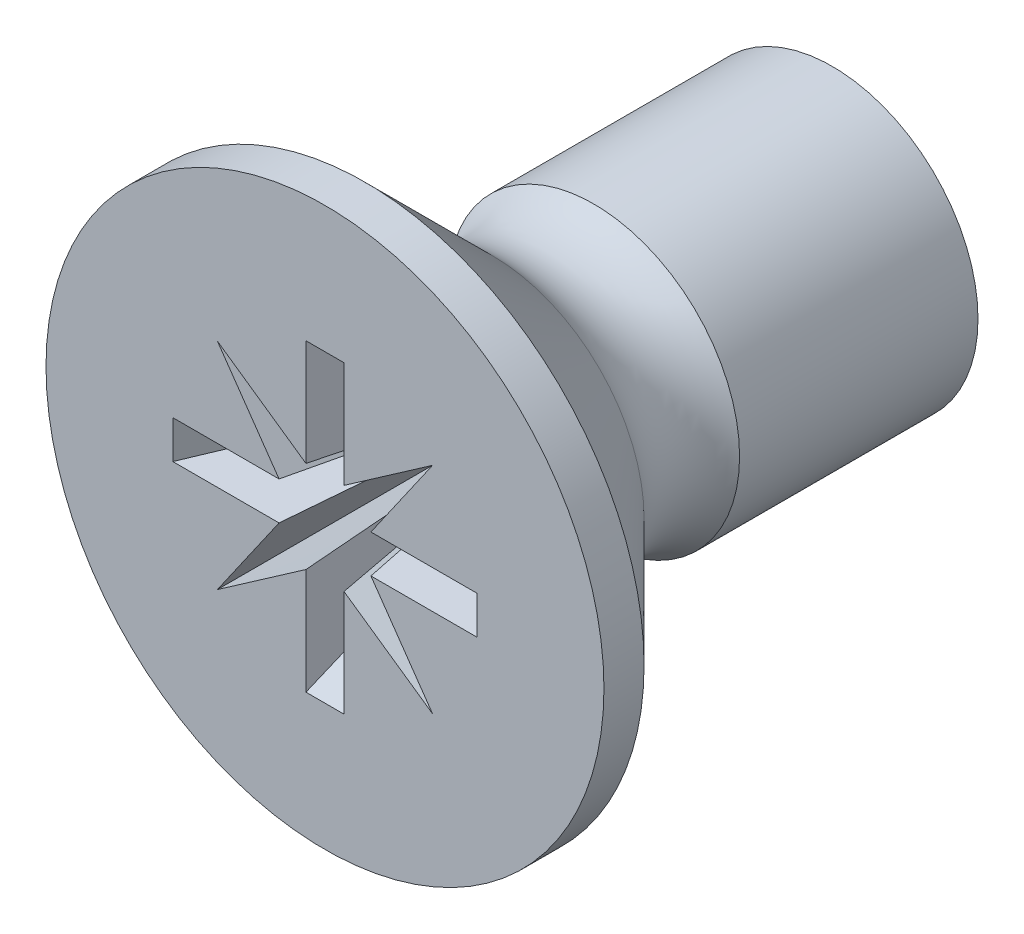
ISO-10303-21;
HEADER;
FILE_DESCRIPTION(('STEP AP214'),'2;1');
FILE_NAME('part.step','',(''),(''),'','','');
FILE_SCHEMA(('AUTOMOTIVE_DESIGN { 1 0 10303 214 1 1 1 1 }'));
ENDSEC;
DATA;
#1=APPLICATION_CONTEXT('core data for automotive mechanical design processes');
#2=APPLICATION_PROTOCOL_DEFINITION('international standard','automotive_design',2000,#1);
#3=PRODUCT_CONTEXT('',#1,'mechanical');
#4=PRODUCT('Part','Part','',(#3));
#5=PRODUCT_RELATED_PRODUCT_CATEGORY('part','',(#4));
#6=PRODUCT_DEFINITION_FORMATION('','',#4);
#7=PRODUCT_DEFINITION_CONTEXT('part definition',#1,'design');
#8=PRODUCT_DEFINITION('design','',#6,#7);
#9=PRODUCT_DEFINITION_SHAPE('','',#8);
#10=(LENGTH_UNIT() NAMED_UNIT(*) SI_UNIT(.MILLI.,.METRE.));
#11=(NAMED_UNIT(*) PLANE_ANGLE_UNIT() SI_UNIT($,.RADIAN.));
#12=(NAMED_UNIT(*) SI_UNIT($,.STERADIAN.) SOLID_ANGLE_UNIT());
#13=UNCERTAINTY_MEASURE_WITH_UNIT(LENGTH_MEASURE(1.E-05),#10,'distance_accuracy_value','');
#14=(GEOMETRIC_REPRESENTATION_CONTEXT(3) GLOBAL_UNCERTAINTY_ASSIGNED_CONTEXT((#13)) GLOBAL_UNIT_ASSIGNED_CONTEXT((#10,
#11,#12)) REPRESENTATION_CONTEXT('',''));
#15=CARTESIAN_POINT('',(0.,0.,0.));
#16=DIRECTION('',(0.,0.,1.));
#17=DIRECTION('',(1.,0.,0.));
#18=AXIS2_PLACEMENT_3D('',#15,#16,#17);
#19=CARTESIAN_POINT('',(0.,0.,-2.18276027382699));
#20=DIRECTION('',(0.,0.,-1.));
#21=DIRECTION('',(-1.,0.,0.));
#22=AXIS2_PLACEMENT_3D('',#19,#20,#21);
#23=TOROIDAL_SURFACE('',#22,2.02806180473974,0.753436804739735);
#24=CARTESIAN_POINT('',(0.,0.,-2.65));
#25=DIRECTION('',(0.,0.,-1.));
#26=DIRECTION('',(-1.,0.,0.));
#27=AXIS2_PLACEMENT_3D('',#24,#25,#26);
#28=CIRCLE('',#27,1.437);
#29=CARTESIAN_POINT('',(-1.437,0.,-2.65));
#30=VERTEX_POINT('',#29);
#31=EDGE_CURVE('E11',#30,#30,#28,.T.);
#32=ORIENTED_EDGE('',*,*,#31,.F.);
#33=EDGE_LOOP('',(#32));
#34=FACE_BOUND('',#33,.T.);
#35=CARTESIAN_POINT('',(0.,0.,-1.65));
#36=DIRECTION('',(0.,0.,-1.));
#37=DIRECTION('',(-1.,0.,0.));
#38=AXIS2_PLACEMENT_3D('',#35,#36,#37);
#39=CIRCLE('',#38,1.49530153091274);
#40=CARTESIAN_POINT('',(-1.49530153091274,0.,-1.65));
#41=VERTEX_POINT('',#40);
#42=EDGE_CURVE('E681',#41,#41,#39,.T.);
#43=ORIENTED_EDGE('',*,*,#42,.T.);
#44=EDGE_LOOP('',(#43));
#45=FACE_BOUND('',#44,.T.);
#46=ADVANCED_FACE('F17',(#34,#45),#23,.F.);
#47=CARTESIAN_POINT('',(0.,0.,0.));
#48=DIRECTION('',(0.,0.,-1.));
#49=DIRECTION('',(-1.,0.,0.));
#50=AXIS2_PLACEMENT_3D('',#47,#48,#49);
#51=CYLINDRICAL_SURFACE('',#50,1.437);
#52=CARTESIAN_POINT('',(0.,0.,-5.));
#53=DIRECTION('',(0.,0.,-1.));
#54=DIRECTION('',(-1.,0.,0.));
#55=AXIS2_PLACEMENT_3D('',#52,#53,#54);
#56=CIRCLE('',#55,1.437);
#57=CARTESIAN_POINT('',(-1.437,0.,-5.));
#58=VERTEX_POINT('',#57);
#59=EDGE_CURVE('E27',#58,#58,#56,.T.);
#60=ORIENTED_EDGE('',*,*,#59,.F.);
#61=EDGE_LOOP('',(#60));
#62=FACE_BOUND('',#61,.T.);
#63=ORIENTED_EDGE('',*,*,#31,.T.);
#64=EDGE_LOOP('',(#63));
#65=FACE_BOUND('',#64,.T.);
#66=ADVANCED_FACE('F671',(#62,#65),#51,.T.);
#67=CARTESIAN_POINT('',(0.,1.437,-5.));
#68=DIRECTION('',(0.,0.,1.));
#69=DIRECTION('',(1.,0.,0.));
#70=AXIS2_PLACEMENT_3D('',#67,#68,#69);
#71=PLANE('',#70);
#72=ORIENTED_EDGE('',*,*,#59,.T.);
#73=EDGE_LOOP('',(#72));
#74=FACE_BOUND('',#73,.T.);
#75=ADVANCED_FACE('F257',(#74),#71,.F.);
#76=CARTESIAN_POINT('',(0.,0.,0.));
#77=DIRECTION('',(0.,0.,-1.));
#78=DIRECTION('',(-1.,0.,0.));
#79=AXIS2_PLACEMENT_3D('',#76,#77,#78);
#80=PLANE('',#79);
#81=DIRECTION('',(0.,-1.,0.));
#82=VECTOR('',#81,1.);
#83=CARTESIAN_POINT('',(0.1875,-0.976332521472478,0.));
#84=LINE('',#83,#82);
#85=CARTESIAN_POINT('',(0.1875,-0.452665042944956,0.));
#86=VERTEX_POINT('',#85);
#87=CARTESIAN_POINT('',(0.1875,-1.5,0.));
#88=VERTEX_POINT('',#87);
#89=EDGE_CURVE('E177',#86,#88,#84,.T.);
#90=ORIENTED_EDGE('',*,*,#89,.T.);
#91=DIRECTION('',(-1.,0.,0.));
#92=VECTOR('',#91,1.);
#93=CARTESIAN_POINT('',(-0.09375,-1.5,0.));
#94=LINE('',#93,#92);
#95=CARTESIAN_POINT('',(-0.1875,-1.5,0.));
#96=VERTEX_POINT('',#95);
#97=EDGE_CURVE('E167',#88,#96,#94,.T.);
#98=ORIENTED_EDGE('',*,*,#97,.T.);
#99=DIRECTION('',(0.,1.,0.));
#100=VECTOR('',#99,1.);
#101=CARTESIAN_POINT('',(-0.1875,-0.976332521472478,0.));
#102=LINE('',#101,#100);
#103=CARTESIAN_POINT('',(-0.1875,-0.452665042944955,0.));
#104=VERTEX_POINT('',#103);
#105=EDGE_CURVE('E41',#96,#104,#102,.T.);
#106=ORIENTED_EDGE('',*,*,#105,.T.);
#107=CARTESIAN_POINT('',(-1.06066017177982,-1.06066017177982,0.));
#108=CARTESIAN_POINT('',(-0.1875,-0.452665042944956,0.));
#109=B_SPLINE_CURVE_WITH_KNOTS('',1,(#107,#108),.UNSPECIFIED.,.F.,.F.,(2,2),(0.,1.),.UNSPECIFIED.);
#110=CARTESIAN_POINT('',(-1.06066017177982,-1.06066017177982,0.));
#111=VERTEX_POINT('',#110);
#112=EDGE_CURVE('E527',#111,#104,#109,.T.);
#113=ORIENTED_EDGE('',*,*,#112,.F.);
#114=CARTESIAN_POINT('',(-0.452665042944956,-0.1875,0.));
#115=CARTESIAN_POINT('',(-1.06066017177982,-1.06066017177982,0.));
#116=B_SPLINE_CURVE_WITH_KNOTS('',1,(#114,#115),.UNSPECIFIED.,.F.,.F.,(2,2),(0.,1.),.UNSPECIFIED.);
#117=CARTESIAN_POINT('',(-0.452665042944956,-0.1875,0.));
#118=VERTEX_POINT('',#117);
#119=EDGE_CURVE('E546',#118,#111,#116,.T.);
#120=ORIENTED_EDGE('',*,*,#119,.F.);
#121=DIRECTION('',(-1.,0.,0.));
#122=VECTOR('',#121,1.);
#123=CARTESIAN_POINT('',(-0.976332521472478,-0.1875,0.));
#124=LINE('',#123,#122);
#125=CARTESIAN_POINT('',(-1.5,-0.1875,0.));
#126=VERTEX_POINT('',#125);
#127=EDGE_CURVE('E549',#118,#126,#124,.T.);
#128=ORIENTED_EDGE('',*,*,#127,.T.);
#129=DIRECTION('',(0.,1.,0.));
#130=VECTOR('',#129,1.);
#131=CARTESIAN_POINT('',(-1.5,-0.09375,0.));
#132=LINE('',#131,#130);
#133=CARTESIAN_POINT('',(-1.5,0.1875,0.));
#134=VERTEX_POINT('',#133);
#135=EDGE_CURVE('E565',#126,#134,#132,.T.);
#136=ORIENTED_EDGE('',*,*,#135,.T.);
#137=DIRECTION('',(1.,0.,0.));
#138=VECTOR('',#137,1.);
#139=CARTESIAN_POINT('',(-0.976332521472478,0.1875,0.));
#140=LINE('',#139,#138);
#141=CARTESIAN_POINT('',(-0.452665042944956,0.1875,0.));
#142=VERTEX_POINT('',#141);
#143=EDGE_CURVE('E588',#134,#142,#140,.T.);
#144=ORIENTED_EDGE('',*,*,#143,.T.);
#145=CARTESIAN_POINT('',(-1.06066017177982,1.06066017177982,0.));
#146=CARTESIAN_POINT('',(-0.452665042944956,0.1875,0.));
#147=B_SPLINE_CURVE_WITH_KNOTS('',1,(#145,#146),.UNSPECIFIED.,.F.,.F.,(2,2),(0.,1.),.UNSPECIFIED.);
#148=CARTESIAN_POINT('',(-1.06066017177982,1.06066017177982,0.));
#149=VERTEX_POINT('',#148);
#150=EDGE_CURVE('E596',#149,#142,#147,.T.);
#151=ORIENTED_EDGE('',*,*,#150,.F.);
#152=CARTESIAN_POINT('',(-0.1875,0.452665042944956,0.));
#153=CARTESIAN_POINT('',(-1.06066017177982,1.06066017177982,0.));
#154=B_SPLINE_CURVE_WITH_KNOTS('',1,(#152,#153),.UNSPECIFIED.,.F.,.F.,(2,2),(0.,1.),.UNSPECIFIED.);
#155=CARTESIAN_POINT('',(-0.1875,0.452665042944956,0.));
#156=VERTEX_POINT('',#155);
#157=EDGE_CURVE('E609',#156,#149,#154,.T.);
#158=ORIENTED_EDGE('',*,*,#157,.F.);
#159=DIRECTION('',(0.,1.,0.));
#160=VECTOR('',#159,1.);
#161=CARTESIAN_POINT('',(-0.1875,0.976332521472478,0.));
#162=LINE('',#161,#160);
#163=CARTESIAN_POINT('',(-0.1875,1.5,0.));
#164=VERTEX_POINT('',#163);
#165=EDGE_CURVE('E612',#156,#164,#162,.T.);
#166=ORIENTED_EDGE('',*,*,#165,.T.);
#167=DIRECTION('',(1.,0.,0.));
#168=VECTOR('',#167,1.);
#169=CARTESIAN_POINT('',(-0.09375,1.5,0.));
#170=LINE('',#169,#168);
#171=CARTESIAN_POINT('',(0.1875,1.5,0.));
#172=VERTEX_POINT('',#171);
#173=EDGE_CURVE('E629',#164,#172,#170,.T.);
#174=ORIENTED_EDGE('',*,*,#173,.T.);
#175=DIRECTION('',(0.,-1.,0.));
#176=VECTOR('',#175,1.);
#177=CARTESIAN_POINT('',(0.1875,0.976332521472478,0.));
#178=LINE('',#177,#176);
#179=CARTESIAN_POINT('',(0.1875,0.452665042944956,0.));
#180=VERTEX_POINT('',#179);
#181=EDGE_CURVE('E326',#172,#180,#178,.T.);
#182=ORIENTED_EDGE('',*,*,#181,.T.);
#183=CARTESIAN_POINT('',(1.06066017177982,1.06066017177982,0.));
#184=CARTESIAN_POINT('',(0.1875,0.452665042944956,0.));
#185=B_SPLINE_CURVE_WITH_KNOTS('',1,(#183,#184),.UNSPECIFIED.,.F.,.F.,(2,2),(0.,1.),.UNSPECIFIED.);
#186=CARTESIAN_POINT('',(1.06066017177982,1.06066017177982,0.));
#187=VERTEX_POINT('',#186);
#188=EDGE_CURVE('E303',#187,#180,#185,.T.);
#189=ORIENTED_EDGE('',*,*,#188,.F.);
#190=CARTESIAN_POINT('',(0.452665042944956,0.1875,0.));
#191=CARTESIAN_POINT('',(1.06066017177982,1.06066017177982,0.));
#192=B_SPLINE_CURVE_WITH_KNOTS('',1,(#190,#191),.UNSPECIFIED.,.F.,.F.,(2,2),(0.,1.),.UNSPECIFIED.);
#193=CARTESIAN_POINT('',(0.452665042944956,0.1875,0.));
#194=VERTEX_POINT('',#193);
#195=EDGE_CURVE('E297',#194,#187,#192,.T.);
#196=ORIENTED_EDGE('',*,*,#195,.F.);
#197=DIRECTION('',(1.,0.,0.));
#198=VECTOR('',#197,1.);
#199=CARTESIAN_POINT('',(0.976332521472478,0.1875,0.));
#200=LINE('',#199,#198);
#201=CARTESIAN_POINT('',(1.5,0.1875,0.));
#202=VERTEX_POINT('',#201);
#203=EDGE_CURVE('E300',#194,#202,#200,.T.);
#204=ORIENTED_EDGE('',*,*,#203,.T.);
#205=DIRECTION('',(0.,-1.,0.));
#206=VECTOR('',#205,1.);
#207=CARTESIAN_POINT('',(1.5,0.09375,0.));
#208=LINE('',#207,#206);
#209=CARTESIAN_POINT('',(1.5,-0.1875,0.));
#210=VERTEX_POINT('',#209);
#211=EDGE_CURVE('E497',#202,#210,#208,.T.);
#212=ORIENTED_EDGE('',*,*,#211,.T.);
#213=DIRECTION('',(-1.,0.,0.));
#214=VECTOR('',#213,1.);
#215=CARTESIAN_POINT('',(0.976332521472478,-0.1875,0.));
#216=LINE('',#215,#214);
#217=CARTESIAN_POINT('',(0.452665042944956,-0.1875,0.));
#218=VERTEX_POINT('',#217);
#219=EDGE_CURVE('E468',#210,#218,#216,.T.);
#220=ORIENTED_EDGE('',*,*,#219,.T.);
#221=CARTESIAN_POINT('',(1.06066017177982,-1.06066017177982,0.));
#222=CARTESIAN_POINT('',(0.452665042944956,-0.1875,0.));
#223=B_SPLINE_CURVE_WITH_KNOTS('',1,(#221,#222),.UNSPECIFIED.,.F.,.F.,(2,2),(0.,1.),.UNSPECIFIED.);
#224=CARTESIAN_POINT('',(1.06066017177982,-1.06066017177982,0.));
#225=VERTEX_POINT('',#224);
#226=EDGE_CURVE('E236',#225,#218,#223,.T.);
#227=ORIENTED_EDGE('',*,*,#226,.F.);
#228=CARTESIAN_POINT('',(0.1875,-0.452665042944956,0.));
#229=CARTESIAN_POINT('',(1.06066017177982,-1.06066017177982,0.));
#230=B_SPLINE_CURVE_WITH_KNOTS('',1,(#228,#229),.UNSPECIFIED.,.F.,.F.,(2,2),(0.,1.),.UNSPECIFIED.);
#231=EDGE_CURVE('E194',#86,#225,#230,.T.);
#232=ORIENTED_EDGE('',*,*,#231,.F.);
#233=EDGE_LOOP('',(#90,#98,#106,#113,#120,#128,#136,#144,#151,#158,#166,#174,#182,#189,#196,
#204,#212,#220,#227,#232));
#234=FACE_BOUND('',#233,.T.);
#235=CARTESIAN_POINT('',(0.,0.,0.));
#236=DIRECTION('',(0.,0.,-1.));
#237=DIRECTION('',(-1.,0.,0.));
#238=AXIS2_PLACEMENT_3D('',#235,#236,#237);
#239=CIRCLE('',#238,2.75);
#240=CARTESIAN_POINT('',(-2.75,0.,0.));
#241=VERTEX_POINT('',#240);
#242=EDGE_CURVE('E686',#241,#241,#239,.T.);
#243=ORIENTED_EDGE('',*,*,#242,.F.);
#244=EDGE_LOOP('',(#243));
#245=FACE_BOUND('',#244,.T.);
#246=ADVANCED_FACE('F238',(#234,#245),#80,.F.);
#247=CARTESIAN_POINT('',(0.,0.,0.));
#248=DIRECTION('',(0.,0.,-1.));
#249=DIRECTION('',(-1.,0.,0.));
#250=AXIS2_PLACEMENT_3D('',#247,#248,#249);
#251=CYLINDRICAL_SURFACE('',#250,2.75);
#252=CARTESIAN_POINT('',(0.,0.,-0.395301530912757));
#253=DIRECTION('',(0.,0.,-1.));
#254=DIRECTION('',(-1.,0.,0.));
#255=AXIS2_PLACEMENT_3D('',#252,#253,#254);
#256=CIRCLE('',#255,2.75);
#257=CARTESIAN_POINT('',(-2.75,0.,-0.395301530912757));
#258=VERTEX_POINT('',#257);
#259=EDGE_CURVE('E683',#258,#258,#256,.T.);
#260=ORIENTED_EDGE('',*,*,#259,.F.);
#261=EDGE_LOOP('',(#260));
#262=FACE_BOUND('',#261,.T.);
#263=ORIENTED_EDGE('',*,*,#242,.T.);
#264=EDGE_LOOP('',(#263));
#265=FACE_BOUND('',#264,.T.);
#266=ADVANCED_FACE('F256',(#262,#265),#251,.T.);
#267=CARTESIAN_POINT('',(0.,0.,-0.395301530912757));
#268=DIRECTION('',(0.,0.,1.));
#269=DIRECTION('',(1.,0.,0.));
#270=AXIS2_PLACEMENT_3D('',#267,#268,#269);
#271=CONICAL_SURFACE('',#270,2.75,0.785398163397454);
#272=ORIENTED_EDGE('',*,*,#42,.F.);
#273=EDGE_LOOP('',(#272));
#274=FACE_BOUND('',#273,.T.);
#275=ORIENTED_EDGE('',*,*,#259,.T.);
#276=EDGE_LOOP('',(#275));
#277=FACE_BOUND('',#276,.T.);
#278=ADVANCED_FACE('F832',(#274,#277),#271,.T.);
#279=CARTESIAN_POINT('',(0.13125,-1.05,-0.88));
#280=DIRECTION('',(-0.997963326741809,0.,0.0637902694650302));
#281=DIRECTION('',(0.0637902694650302,0.,0.997963326741809));
#282=AXIS2_PLACEMENT_3D('',#279,#280,#281);
#283=PLANE('',#282);
#284=CARTESIAN_POINT('',(0.075,-0.181066017177982,-1.76));
#285=CARTESIAN_POINT('',(0.1875,-0.452665042944956,0.));
#286=B_SPLINE_CURVE_WITH_KNOTS('',1,(#284,#285),.UNSPECIFIED.,.F.,.F.,(2,2),(0.,1.),.UNSPECIFIED.);
#287=CARTESIAN_POINT('',(0.075,-0.181066017177982,-1.76));
#288=VERTEX_POINT('',#287);
#289=EDGE_CURVE('E180',#288,#86,#286,.T.);
#290=ORIENTED_EDGE('',*,*,#289,.F.);
#291=DIRECTION('',(0.,-1.,0.));
#292=VECTOR('',#291,1.);
#293=CARTESIAN_POINT('',(0.075,-0.390533008588991,-1.76));
#294=LINE('',#293,#292);
#295=CARTESIAN_POINT('',(0.075,-0.6,-1.76));
#296=VERTEX_POINT('',#295);
#297=EDGE_CURVE('E163',#288,#296,#294,.T.);
#298=ORIENTED_EDGE('',*,*,#297,.T.);
#299=DIRECTION('',(0.0568192235279889,-0.454553788223912,0.888905185860094));
#300=VECTOR('',#299,1.);
#301=CARTESIAN_POINT('',(0.13125,-1.05,-0.88));
#302=LINE('',#301,#300);
#303=EDGE_CURVE('E171',#296,#88,#302,.T.);
#304=ORIENTED_EDGE('',*,*,#303,.T.);
#305=ORIENTED_EDGE('',*,*,#89,.F.);
#306=EDGE_LOOP('',(#290,#298,#304,#305));
#307=FACE_BOUND('',#306,.T.);
#308=ADVANCED_FACE('F179',(#307),#283,.T.);
#309=CARTESIAN_POINT('',(0.419478270999549,-0.41947827099955,-1.76));
#310=CARTESIAN_POINT('',(1.06066017177982,-1.06066017177982,0.));
#311=CARTESIAN_POINT('',(0.075,-0.181066017177982,-1.76));
#312=CARTESIAN_POINT('',(0.1875,-0.452665042944956,0.));
#313=B_SPLINE_SURFACE_WITH_KNOTS('',1,1,((#309,#310),(#311,#312)),.UNSPECIFIED.,.F.,.F.,.F.,(2,
2),(2,2),(0.,1.),(0.,1.),.UNSPECIFIED.);
#314=CARTESIAN_POINT('',(0.419478270999549,-0.41947827099955,-1.76));
#315=CARTESIAN_POINT('',(0.075,-0.181066017177982,-1.76));
#316=B_SPLINE_CURVE_WITH_KNOTS('',1,(#314,#315),.UNSPECIFIED.,.F.,.F.,(2,2),(0.,1.),.UNSPECIFIED.);
#317=CARTESIAN_POINT('',(0.419478270999549,-0.41947827099955,-1.76));
#318=VERTEX_POINT('',#317);
#319=EDGE_CURVE('E235',#318,#288,#316,.T.);
#320=CARTESIAN_POINT('',(0.419478270999549,-0.41947827099955,-1.76));
#321=CARTESIAN_POINT('',(1.06066017177982,-1.06066017177982,0.));
#322=B_SPLINE_CURVE_WITH_KNOTS('',1,(#320,#321),.UNSPECIFIED.,.F.,.F.,(2,2),(0.,1.),.UNSPECIFIED.);
#323=EDGE_CURVE('E476',#318,#225,#322,.T.);
#324=ORIENTED_EDGE('',*,*,#319,.T.);
#325=ORIENTED_EDGE('',*,*,#289,.T.);
#326=ORIENTED_EDGE('',*,*,#231,.T.);
#327=ORIENTED_EDGE('',*,*,#323,.F.);
#328=EDGE_LOOP('',(#324,#325,#326,#327));
#329=FACE_BOUND('',#328,.T.);
#330=ADVANCED_FACE('F201',(#329),#313,.T.);
#331=CARTESIAN_POINT('',(0.181066017177982,-0.075,-1.76));
#332=CARTESIAN_POINT('',(0.452665042944956,-0.1875,0.));
#333=CARTESIAN_POINT('',(0.419478270999549,-0.41947827099955,-1.76));
#334=CARTESIAN_POINT('',(1.06066017177982,-1.06066017177982,0.));
#335=B_SPLINE_SURFACE_WITH_KNOTS('',1,1,((#331,#332),(#333,#334)),.UNSPECIFIED.,.F.,.F.,.F.,(2,
2),(2,2),(0.,1.),(0.,1.),.UNSPECIFIED.);
#336=CARTESIAN_POINT('',(0.181066017177982,-0.075,-1.76));
#337=CARTESIAN_POINT('',(0.419478270999549,-0.41947827099955,-1.76));
#338=B_SPLINE_CURVE_WITH_KNOTS('',1,(#336,#337),.UNSPECIFIED.,.F.,.F.,(2,2),(0.,1.),.UNSPECIFIED.);
#339=CARTESIAN_POINT('',(0.181066017177982,-0.075,-1.76));
#340=VERTEX_POINT('',#339);
#341=EDGE_CURVE('E457',#340,#318,#338,.T.);
#342=DIRECTION('',(0.152208939027645,-0.0630470068596701,0.986335396204615));
#343=VECTOR('',#342,1.);
#344=CARTESIAN_POINT('',(0.316865530061469,-0.13125,-0.88));
#345=LINE('',#344,#343);
#346=EDGE_CURVE('E461',#340,#218,#345,.T.);
#347=ORIENTED_EDGE('',*,*,#341,.T.);
#348=ORIENTED_EDGE('',*,*,#323,.T.);
#349=ORIENTED_EDGE('',*,*,#226,.T.);
#350=ORIENTED_EDGE('',*,*,#346,.F.);
#351=EDGE_LOOP('',(#347,#348,#349,#350));
#352=FACE_BOUND('',#351,.T.);
#353=ADVANCED_FACE('F213',(#352),#335,.T.);
#354=CARTESIAN_POINT('',(1.05,-0.13125,-0.88));
#355=DIRECTION('',(0.,0.997963326741809,0.0637902694650306));
#356=DIRECTION('',(0.,-0.0637902694650306,0.997963326741809));
#357=AXIS2_PLACEMENT_3D('',#354,#355,#356);
#358=PLANE('',#357);
#359=DIRECTION('',(0.454553788223912,-0.056819223527989,0.888905185860094));
#360=VECTOR('',#359,1.);
#361=CARTESIAN_POINT('',(1.05,-0.13125,-0.88));
#362=LINE('',#361,#360);
#363=CARTESIAN_POINT('',(0.6,-0.075,-1.76));
#364=VERTEX_POINT('',#363);
#365=EDGE_CURVE('E500',#364,#210,#362,.T.);
#366=ORIENTED_EDGE('',*,*,#365,.F.);
#367=DIRECTION('',(-1.,0.,0.));
#368=VECTOR('',#367,1.);
#369=CARTESIAN_POINT('',(0.390533008588991,-0.075,-1.76));
#370=LINE('',#369,#368);
#371=EDGE_CURVE('E469',#364,#340,#370,.T.);
#372=ORIENTED_EDGE('',*,*,#371,.T.);
#373=ORIENTED_EDGE('',*,*,#346,.T.);
#374=ORIENTED_EDGE('',*,*,#219,.F.);
#375=EDGE_LOOP('',(#366,#372,#373,#374));
#376=FACE_BOUND('',#375,.T.);
#377=ADVANCED_FACE('F803',(#376),#358,.T.);
#378=CARTESIAN_POINT('',(1.05,0.13125,-0.88));
#379=DIRECTION('',(-0.890343551028259,0.,0.455289315866724));
#380=DIRECTION('',(0.455289315866724,0.,0.89034355102826));
#381=AXIS2_PLACEMENT_3D('',#378,#379,#380);
#382=PLANE('',#381);
#383=DIRECTION('',(0.454553788223912,0.056819223527989,0.888905185860094));
#384=VECTOR('',#383,1.);
#385=CARTESIAN_POINT('',(1.05,0.13125,-0.88));
#386=LINE('',#385,#384);
#387=CARTESIAN_POINT('',(0.6,0.075,-1.76));
#388=VERTEX_POINT('',#387);
#389=EDGE_CURVE('E309',#388,#202,#386,.T.);
#390=ORIENTED_EDGE('',*,*,#389,.F.);
#391=DIRECTION('',(0.,-1.,0.));
#392=VECTOR('',#391,1.);
#393=CARTESIAN_POINT('',(0.6,0.0375,-1.76));
#394=LINE('',#393,#392);
#395=EDGE_CURVE('E502',#388,#364,#394,.T.);
#396=ORIENTED_EDGE('',*,*,#395,.T.);
#397=ORIENTED_EDGE('',*,*,#365,.T.);
#398=ORIENTED_EDGE('',*,*,#211,.F.);
#399=EDGE_LOOP('',(#390,#396,#397,#398));
#400=FACE_BOUND('',#399,.T.);
#401=ADVANCED_FACE('F669',(#400),#382,.T.);
#402=CARTESIAN_POINT('',(1.05,0.13125,-0.88));
#403=DIRECTION('',(0.,-0.997963326741809,0.0637902694650305));
#404=DIRECTION('',(0.,-0.0637902694650305,-0.997963326741809));
#405=AXIS2_PLACEMENT_3D('',#402,#403,#404);
#406=PLANE('',#405);
#407=CARTESIAN_POINT('',(0.181066017177982,0.075,-1.76));
#408=CARTESIAN_POINT('',(0.452665042944956,0.1875,0.));
#409=B_SPLINE_CURVE_WITH_KNOTS('',1,(#407,#408),.UNSPECIFIED.,.F.,.F.,(2,2),(0.,1.),.UNSPECIFIED.);
#410=CARTESIAN_POINT('',(0.181066017177982,0.075,-1.76));
#411=VERTEX_POINT('',#410);
#412=EDGE_CURVE('E306',#411,#194,#409,.T.);
#413=ORIENTED_EDGE('',*,*,#412,.F.);
#414=DIRECTION('',(1.,0.,0.));
#415=VECTOR('',#414,1.);
#416=CARTESIAN_POINT('',(0.390533008588991,0.075,-1.76));
#417=LINE('',#416,#415);
#418=EDGE_CURVE('E311',#411,#388,#417,.T.);
#419=ORIENTED_EDGE('',*,*,#418,.T.);
#420=ORIENTED_EDGE('',*,*,#389,.T.);
#421=ORIENTED_EDGE('',*,*,#203,.F.);
#422=EDGE_LOOP('',(#413,#419,#420,#421));
#423=FACE_BOUND('',#422,.T.);
#424=ADVANCED_FACE('F662',(#423),#406,.T.);
#425=CARTESIAN_POINT('',(0.419478270999549,0.41947827099955,-1.76));
#426=CARTESIAN_POINT('',(1.06066017177982,1.06066017177982,0.));
#427=CARTESIAN_POINT('',(0.181066017177982,0.075,-1.76));
#428=CARTESIAN_POINT('',(0.452665042944956,0.1875,0.));
#429=B_SPLINE_SURFACE_WITH_KNOTS('',1,1,((#425,#426),(#427,#428)),.UNSPECIFIED.,.F.,.F.,.F.,(2,
2),(2,2),(0.,1.),(0.,1.),.UNSPECIFIED.);
#430=CARTESIAN_POINT('',(0.419478270999549,0.41947827099955,-1.76));
#431=CARTESIAN_POINT('',(0.181066017177982,0.075,-1.76));
#432=B_SPLINE_CURVE_WITH_KNOTS('',1,(#430,#431),.UNSPECIFIED.,.F.,.F.,(2,2),(0.,1.),.UNSPECIFIED.);
#433=CARTESIAN_POINT('',(0.419478270999549,0.41947827099955,-1.76));
#434=VERTEX_POINT('',#433);
#435=EDGE_CURVE('E307',#434,#411,#432,.T.);
#436=CARTESIAN_POINT('',(0.419478270999549,0.41947827099955,-1.76));
#437=CARTESIAN_POINT('',(1.06066017177982,1.06066017177982,0.));
#438=B_SPLINE_CURVE_WITH_KNOTS('',1,(#436,#437),.UNSPECIFIED.,.F.,.F.,(2,2),(0.,1.),.UNSPECIFIED.);
#439=EDGE_CURVE('E374',#434,#187,#438,.T.);
#440=ORIENTED_EDGE('',*,*,#435,.T.);
#441=ORIENTED_EDGE('',*,*,#412,.T.);
#442=ORIENTED_EDGE('',*,*,#195,.T.);
#443=ORIENTED_EDGE('',*,*,#439,.F.);
#444=EDGE_LOOP('',(#440,#441,#442,#443));
#445=FACE_BOUND('',#444,.T.);
#446=ADVANCED_FACE('F340',(#445),#429,.T.);
#447=CARTESIAN_POINT('',(0.075,0.181066017177982,-1.76));
#448=CARTESIAN_POINT('',(0.1875,0.452665042944956,0.));
#449=CARTESIAN_POINT('',(0.419478270999549,0.41947827099955,-1.76));
#450=CARTESIAN_POINT('',(1.06066017177982,1.06066017177982,0.));
#451=B_SPLINE_SURFACE_WITH_KNOTS('',1,1,((#447,#448),(#449,#450)),.UNSPECIFIED.,.F.,.F.,.F.,(2,
2),(2,2),(0.,1.),(0.,1.),.UNSPECIFIED.);
#452=CARTESIAN_POINT('',(0.075,0.181066017177982,-1.76));
#453=CARTESIAN_POINT('',(0.419478270999549,0.41947827099955,-1.76));
#454=B_SPLINE_CURVE_WITH_KNOTS('',1,(#452,#453),.UNSPECIFIED.,.F.,.F.,(2,2),(0.,1.),.UNSPECIFIED.);
#455=CARTESIAN_POINT('',(0.075,0.181066017177982,-1.76));
#456=VERTEX_POINT('',#455);
#457=EDGE_CURVE('E371',#456,#434,#454,.T.);
#458=DIRECTION('',(0.06304700685967,0.152208939027645,0.986335396204615));
#459=VECTOR('',#458,1.);
#460=CARTESIAN_POINT('',(0.13125,0.316865530061469,-0.88));
#461=LINE('',#460,#459);
#462=EDGE_CURVE('E359',#456,#180,#461,.T.);
#463=ORIENTED_EDGE('',*,*,#457,.T.);
#464=ORIENTED_EDGE('',*,*,#439,.T.);
#465=ORIENTED_EDGE('',*,*,#188,.T.);
#466=ORIENTED_EDGE('',*,*,#462,.F.);
#467=EDGE_LOOP('',(#463,#464,#465,#466));
#468=FACE_BOUND('',#467,.T.);
#469=ADVANCED_FACE('F328',(#468),#451,.T.);
#470=CARTESIAN_POINT('',(0.13125,1.05,-0.88));
#471=DIRECTION('',(-0.997963326741809,0.,0.0637902694650304));
#472=DIRECTION('',(0.0637902694650304,0.,0.997963326741809));
#473=AXIS2_PLACEMENT_3D('',#470,#471,#472);
#474=PLANE('',#473);
#475=DIRECTION('',(0.0568192235279889,0.454553788223912,0.888905185860094));
#476=VECTOR('',#475,1.);
#477=CARTESIAN_POINT('',(0.13125,1.05,-0.88));
#478=LINE('',#477,#476);
#479=CARTESIAN_POINT('',(0.075,0.6,-1.76));
#480=VERTEX_POINT('',#479);
#481=EDGE_CURVE('E636',#480,#172,#478,.T.);
#482=ORIENTED_EDGE('',*,*,#481,.F.);
#483=DIRECTION('',(0.,-1.,0.));
#484=VECTOR('',#483,1.);
#485=CARTESIAN_POINT('',(0.075,0.390533008588991,-1.76));
#486=LINE('',#485,#484);
#487=EDGE_CURVE('E366',#480,#456,#486,.T.);
#488=ORIENTED_EDGE('',*,*,#487,.T.);
#489=ORIENTED_EDGE('',*,*,#462,.T.);
#490=ORIENTED_EDGE('',*,*,#181,.F.);
#491=EDGE_LOOP('',(#482,#488,#489,#490));
#492=FACE_BOUND('',#491,.T.);
#493=ADVANCED_FACE('F339',(#492),#474,.T.);
#494=CARTESIAN_POINT('',(-0.13125,1.05,-0.88));
#495=DIRECTION('',(0.,-0.890343551028259,0.455289315866724));
#496=DIRECTION('',(0.,-0.455289315866724,-0.89034355102826));
#497=AXIS2_PLACEMENT_3D('',#494,#495,#496);
#498=PLANE('',#497);
#499=DIRECTION('',(-0.0568192235279889,0.454553788223912,0.888905185860094));
#500=VECTOR('',#499,1.);
#501=CARTESIAN_POINT('',(-0.13125,1.05,-0.88));
#502=LINE('',#501,#500);
#503=CARTESIAN_POINT('',(-0.075,0.6,-1.76));
#504=VERTEX_POINT('',#503);
#505=EDGE_CURVE('E628',#504,#164,#502,.T.);
#506=ORIENTED_EDGE('',*,*,#505,.F.);
#507=DIRECTION('',(1.,0.,0.));
#508=VECTOR('',#507,1.);
#509=CARTESIAN_POINT('',(-0.0375,0.6,-1.76));
#510=LINE('',#509,#508);
#511=EDGE_CURVE('E640',#504,#480,#510,.T.);
#512=ORIENTED_EDGE('',*,*,#511,.T.);
#513=ORIENTED_EDGE('',*,*,#481,.T.);
#514=ORIENTED_EDGE('',*,*,#173,.F.);
#515=EDGE_LOOP('',(#506,#512,#513,#514));
#516=FACE_BOUND('',#515,.T.);
#517=ADVANCED_FACE('F732',(#516),#498,.T.);
#518=CARTESIAN_POINT('',(-0.13125,1.05,-0.88));
#519=DIRECTION('',(0.997963326741809,0.,0.0637902694650306));
#520=DIRECTION('',(0.0637902694650306,0.,-0.997963326741809));
#521=AXIS2_PLACEMENT_3D('',#518,#519,#520);
#522=PLANE('',#521);
#523=CARTESIAN_POINT('',(-0.075,0.181066017177982,-1.76));
#524=CARTESIAN_POINT('',(-0.1875,0.452665042944956,0.));
#525=B_SPLINE_CURVE_WITH_KNOTS('',1,(#523,#524),.UNSPECIFIED.,.F.,.F.,(2,2),(0.,1.),.UNSPECIFIED.);
#526=CARTESIAN_POINT('',(-0.075,0.181066017177982,-1.76));
#527=VERTEX_POINT('',#526);
#528=EDGE_CURVE('E607',#527,#156,#525,.T.);
#529=ORIENTED_EDGE('',*,*,#528,.F.);
#530=DIRECTION('',(0.,1.,0.));
#531=VECTOR('',#530,1.);
#532=CARTESIAN_POINT('',(-0.075,0.390533008588991,-1.76));
#533=LINE('',#532,#531);
#534=EDGE_CURVE('E622',#527,#504,#533,.T.);
#535=ORIENTED_EDGE('',*,*,#534,.T.);
#536=ORIENTED_EDGE('',*,*,#505,.T.);
#537=ORIENTED_EDGE('',*,*,#165,.F.);
#538=EDGE_LOOP('',(#529,#535,#536,#537));
#539=FACE_BOUND('',#538,.T.);
#540=ADVANCED_FACE('F734',(#539),#522,.T.);
#541=CARTESIAN_POINT('',(-0.419478270999549,0.41947827099955,-1.76));
#542=CARTESIAN_POINT('',(-1.06066017177982,1.06066017177982,0.));
#543=CARTESIAN_POINT('',(-0.075,0.181066017177982,-1.76));
#544=CARTESIAN_POINT('',(-0.1875,0.452665042944956,0.));
#545=B_SPLINE_SURFACE_WITH_KNOTS('',1,1,((#541,#542),(#543,#544)),.UNSPECIFIED.,.F.,.F.,.F.,(2,
2),(2,2),(0.,1.),(0.,1.),.UNSPECIFIED.);
#546=CARTESIAN_POINT('',(-0.419478270999549,0.41947827099955,-1.76));
#547=CARTESIAN_POINT('',(-0.075,0.181066017177982,-1.76));
#548=B_SPLINE_CURVE_WITH_KNOTS('',1,(#546,#547),.UNSPECIFIED.,.F.,.F.,(2,2),(0.,1.),.UNSPECIFIED.);
#549=CARTESIAN_POINT('',(-0.419478270999549,0.41947827099955,-1.76));
#550=VERTEX_POINT('',#549);
#551=EDGE_CURVE('E577',#550,#527,#548,.T.);
#552=CARTESIAN_POINT('',(-0.419478270999549,0.41947827099955,-1.76));
#553=CARTESIAN_POINT('',(-1.06066017177982,1.06066017177982,0.));
#554=B_SPLINE_CURVE_WITH_KNOTS('',1,(#552,#553),.UNSPECIFIED.,.F.,.F.,(2,2),(0.,1.),.UNSPECIFIED.);
#555=EDGE_CURVE('E579',#550,#149,#554,.T.);
#556=ORIENTED_EDGE('',*,*,#551,.T.);
#557=ORIENTED_EDGE('',*,*,#528,.T.);
#558=ORIENTED_EDGE('',*,*,#157,.T.);
#559=ORIENTED_EDGE('',*,*,#555,.F.);
#560=EDGE_LOOP('',(#556,#557,#558,#559));
#561=FACE_BOUND('',#560,.T.);
#562=ADVANCED_FACE('F737',(#561),#545,.T.);
#563=CARTESIAN_POINT('',(-0.181066017177982,0.075,-1.76));
#564=CARTESIAN_POINT('',(-0.452665042944956,0.1875,0.));
#565=CARTESIAN_POINT('',(-0.419478270999549,0.41947827099955,-1.76));
#566=CARTESIAN_POINT('',(-1.06066017177982,1.06066017177982,0.));
#567=B_SPLINE_SURFACE_WITH_KNOTS('',1,1,((#563,#564),(#565,#566)),.UNSPECIFIED.,.F.,.F.,.F.,(2,
2),(2,2),(0.,1.),(0.,1.),.UNSPECIFIED.);
#568=CARTESIAN_POINT('',(-0.181066017177982,0.075,-1.76));
#569=CARTESIAN_POINT('',(-0.419478270999549,0.41947827099955,-1.76));
#570=B_SPLINE_CURVE_WITH_KNOTS('',1,(#568,#569),.UNSPECIFIED.,.F.,.F.,(2,2),(0.,1.),.UNSPECIFIED.);
#571=CARTESIAN_POINT('',(-0.181066017177982,0.075,-1.76));
#572=VERTEX_POINT('',#571);
#573=EDGE_CURVE('E571',#572,#550,#570,.T.);
#574=DIRECTION('',(-0.152208939027645,0.0630470068596701,0.986335396204615));
#575=VECTOR('',#574,1.);
#576=CARTESIAN_POINT('',(-0.316865530061469,0.13125,-0.88));
#577=LINE('',#576,#575);
#578=EDGE_CURVE('E584',#572,#142,#577,.T.);
#579=ORIENTED_EDGE('',*,*,#573,.T.);
#580=ORIENTED_EDGE('',*,*,#555,.T.);
#581=ORIENTED_EDGE('',*,*,#150,.T.);
#582=ORIENTED_EDGE('',*,*,#578,.F.);
#583=EDGE_LOOP('',(#579,#580,#581,#582));
#584=FACE_BOUND('',#583,.T.);
#585=ADVANCED_FACE('F754',(#584),#567,.T.);
#586=CARTESIAN_POINT('',(-1.05,0.13125,-0.88));
#587=DIRECTION('',(0.,-0.997963326741809,0.0637902694650306));
#588=DIRECTION('',(0.,-0.0637902694650306,-0.997963326741809));
#589=AXIS2_PLACEMENT_3D('',#586,#587,#588);
#590=PLANE('',#589);
#591=DIRECTION('',(-0.454553788223912,0.056819223527989,0.888905185860094));
#592=VECTOR('',#591,1.);
#593=CARTESIAN_POINT('',(-1.05,0.13125,-0.88));
#594=LINE('',#593,#592);
#595=CARTESIAN_POINT('',(-0.6,0.075,-1.76));
#596=VERTEX_POINT('',#595);
#597=EDGE_CURVE('E586',#596,#134,#594,.T.);
#598=ORIENTED_EDGE('',*,*,#597,.F.);
#599=DIRECTION('',(1.,0.,0.));
#600=VECTOR('',#599,1.);
#601=CARTESIAN_POINT('',(-0.390533008588991,0.075,-1.76));
#602=LINE('',#601,#600);
#603=EDGE_CURVE('E574',#596,#572,#602,.T.);
#604=ORIENTED_EDGE('',*,*,#603,.T.);
#605=ORIENTED_EDGE('',*,*,#578,.T.);
#606=ORIENTED_EDGE('',*,*,#143,.F.);
#607=EDGE_LOOP('',(#598,#604,#605,#606));
#608=FACE_BOUND('',#607,.T.);
#609=ADVANCED_FACE('F582',(#608),#590,.T.);
#610=CARTESIAN_POINT('',(-1.05,-0.13125,-0.88));
#611=DIRECTION('',(0.890343551028259,0.,0.455289315866724));
#612=DIRECTION('',(0.455289315866724,0.,-0.89034355102826));
#613=AXIS2_PLACEMENT_3D('',#610,#611,#612);
#614=PLANE('',#613);
#615=DIRECTION('',(-0.454553788223912,-0.056819223527989,0.888905185860094));
#616=VECTOR('',#615,1.);
#617=CARTESIAN_POINT('',(-1.05,-0.13125,-0.88));
#618=LINE('',#617,#616);
#619=CARTESIAN_POINT('',(-0.6,-0.075,-1.76));
#620=VERTEX_POINT('',#619);
#621=EDGE_CURVE('E564',#620,#126,#618,.T.);
#622=ORIENTED_EDGE('',*,*,#621,.F.);
#623=DIRECTION('',(0.,1.,0.));
#624=VECTOR('',#623,1.);
#625=CARTESIAN_POINT('',(-0.6,-0.0375,-1.76));
#626=LINE('',#625,#624);
#627=EDGE_CURVE('E727',#620,#596,#626,.T.);
#628=ORIENTED_EDGE('',*,*,#627,.T.);
#629=ORIENTED_EDGE('',*,*,#597,.T.);
#630=ORIENTED_EDGE('',*,*,#135,.F.);
#631=EDGE_LOOP('',(#622,#628,#629,#630));
#632=FACE_BOUND('',#631,.T.);
#633=ADVANCED_FACE('F911',(#632),#614,.T.);
#634=CARTESIAN_POINT('',(-1.05,-0.13125,-0.88));
#635=DIRECTION('',(0.,0.997963326741809,0.0637902694650305));
#636=DIRECTION('',(0.,-0.0637902694650305,0.997963326741809));
#637=AXIS2_PLACEMENT_3D('',#634,#635,#636);
#638=PLANE('',#637);
#639=CARTESIAN_POINT('',(-0.181066017177982,-0.075,-1.76));
#640=CARTESIAN_POINT('',(-0.452665042944956,-0.1875,0.));
#641=B_SPLINE_CURVE_WITH_KNOTS('',1,(#639,#640),.UNSPECIFIED.,.F.,.F.,(2,2),(0.,1.),.UNSPECIFIED.);
#642=CARTESIAN_POINT('',(-0.181066017177982,-0.075,-1.76));
#643=VERTEX_POINT('',#642);
#644=EDGE_CURVE('E544',#643,#118,#641,.T.);
#645=ORIENTED_EDGE('',*,*,#644,.F.);
#646=DIRECTION('',(-1.,0.,0.));
#647=VECTOR('',#646,1.);
#648=CARTESIAN_POINT('',(-0.390533008588991,-0.075,-1.76));
#649=LINE('',#648,#647);
#650=EDGE_CURVE('E558',#643,#620,#649,.T.);
#651=ORIENTED_EDGE('',*,*,#650,.T.);
#652=ORIENTED_EDGE('',*,*,#621,.T.);
#653=ORIENTED_EDGE('',*,*,#127,.F.);
#654=EDGE_LOOP('',(#645,#651,#652,#653));
#655=FACE_BOUND('',#654,.T.);
#656=ADVANCED_FACE('F918',(#655),#638,.T.);
#657=CARTESIAN_POINT('',(-0.419478270999549,-0.41947827099955,-1.76));
#658=CARTESIAN_POINT('',(-1.06066017177982,-1.06066017177982,0.));
#659=CARTESIAN_POINT('',(-0.181066017177982,-0.075,-1.76));
#660=CARTESIAN_POINT('',(-0.452665042944956,-0.1875,0.));
#661=B_SPLINE_SURFACE_WITH_KNOTS('',1,1,((#657,#658),(#659,#660)),.UNSPECIFIED.,.F.,.F.,.F.,(2,
2),(2,2),(0.,1.),(0.,1.),.UNSPECIFIED.);
#662=CARTESIAN_POINT('',(-0.419478270999549,-0.41947827099955,-1.76));
#663=CARTESIAN_POINT('',(-0.181066017177982,-0.075,-1.76));
#664=B_SPLINE_CURVE_WITH_KNOTS('',1,(#662,#663),.UNSPECIFIED.,.F.,.F.,(2,2),(0.,1.),.UNSPECIFIED.);
#665=CARTESIAN_POINT('',(-0.419478270999549,-0.41947827099955,-1.76));
#666=VERTEX_POINT('',#665);
#667=EDGE_CURVE('E519',#666,#643,#664,.T.);
#668=CARTESIAN_POINT('',(-0.419478270999549,-0.41947827099955,-1.76));
#669=CARTESIAN_POINT('',(-1.06066017177982,-1.06066017177982,0.));
#670=B_SPLINE_CURVE_WITH_KNOTS('',1,(#668,#669),.UNSPECIFIED.,.F.,.F.,(2,2),(0.,1.),.UNSPECIFIED.);
#671=EDGE_CURVE('E522',#666,#111,#670,.T.);
#672=ORIENTED_EDGE('',*,*,#667,.T.);
#673=ORIENTED_EDGE('',*,*,#644,.T.);
#674=ORIENTED_EDGE('',*,*,#119,.T.);
#675=ORIENTED_EDGE('',*,*,#671,.F.);
#676=EDGE_LOOP('',(#672,#673,#674,#675));
#677=FACE_BOUND('',#676,.T.);
#678=ADVANCED_FACE('F403',(#677),#661,.T.);
#679=CARTESIAN_POINT('',(0.,0.,-1.76));
#680=DIRECTION('',(0.,0.,-1.));
#681=DIRECTION('',(-1.,0.,0.));
#682=AXIS2_PLACEMENT_3D('',#679,#680,#681);
#683=PLANE('',#682);
#684=ORIENTED_EDGE('',*,*,#297,.F.);
#685=ORIENTED_EDGE('',*,*,#319,.F.);
#686=ORIENTED_EDGE('',*,*,#341,.F.);
#687=ORIENTED_EDGE('',*,*,#371,.F.);
#688=ORIENTED_EDGE('',*,*,#395,.F.);
#689=ORIENTED_EDGE('',*,*,#418,.F.);
#690=ORIENTED_EDGE('',*,*,#435,.F.);
#691=ORIENTED_EDGE('',*,*,#457,.F.);
#692=ORIENTED_EDGE('',*,*,#487,.F.);
#693=ORIENTED_EDGE('',*,*,#511,.F.);
#694=ORIENTED_EDGE('',*,*,#534,.F.);
#695=ORIENTED_EDGE('',*,*,#551,.F.);
#696=ORIENTED_EDGE('',*,*,#573,.F.);
#697=ORIENTED_EDGE('',*,*,#603,.F.);
#698=ORIENTED_EDGE('',*,*,#627,.F.);
#699=ORIENTED_EDGE('',*,*,#650,.F.);
#700=ORIENTED_EDGE('',*,*,#667,.F.);
#701=CARTESIAN_POINT('',(-0.075,-0.181066017177982,-1.76));
#702=CARTESIAN_POINT('',(-0.419478270999549,-0.41947827099955,-1.76));
#703=B_SPLINE_CURVE_WITH_KNOTS('',1,(#701,#702),.UNSPECIFIED.,.F.,.F.,(2,2),(0.,1.),.UNSPECIFIED.);
#704=CARTESIAN_POINT('',(-0.075,-0.181066017177982,-1.76));
#705=VERTEX_POINT('',#704);
#706=EDGE_CURVE('E168',#705,#666,#703,.T.);
#707=ORIENTED_EDGE('',*,*,#706,.F.);
#708=DIRECTION('',(0.,1.,0.));
#709=VECTOR('',#708,1.);
#710=CARTESIAN_POINT('',(-0.075,-0.390533008588991,-1.76));
#711=LINE('',#710,#709);
#712=CARTESIAN_POINT('',(-0.075,-0.6,-1.76));
#713=VERTEX_POINT('',#712);
#714=EDGE_CURVE('E165',#713,#705,#711,.T.);
#715=ORIENTED_EDGE('',*,*,#714,.F.);
#716=DIRECTION('',(-1.,0.,0.));
#717=VECTOR('',#716,1.);
#718=CARTESIAN_POINT('',(-0.0375,-0.6,-1.76));
#719=LINE('',#718,#717);
#720=EDGE_CURVE('E158',#296,#713,#719,.T.);
#721=ORIENTED_EDGE('',*,*,#720,.F.);
#722=EDGE_LOOP('',(#684,#685,#686,#687,#688,#689,#690,#691,#692,#693,#694,#695,#696,#697,#698,
#699,#700,#707,#715,#721));
#723=FACE_BOUND('',#722,.T.);
#724=ADVANCED_FACE('F160',(#723),#683,.F.);
#725=CARTESIAN_POINT('',(-0.075,-0.181066017177982,-1.76));
#726=CARTESIAN_POINT('',(-0.1875,-0.452665042944956,0.));
#727=CARTESIAN_POINT('',(-0.419478270999549,-0.41947827099955,-1.76));
#728=CARTESIAN_POINT('',(-1.06066017177982,-1.06066017177982,0.));
#729=B_SPLINE_SURFACE_WITH_KNOTS('',1,1,((#725,#726),(#727,#728)),.UNSPECIFIED.,.F.,.F.,.F.,(2,
2),(2,2),(0.,1.),(0.,1.),.UNSPECIFIED.);
#730=DIRECTION('',(-0.0630470068596699,-0.152208939027645,0.986335396204615));
#731=VECTOR('',#730,1.);
#732=CARTESIAN_POINT('',(-0.13125,-0.316865530061469,-0.88));
#733=LINE('',#732,#731);
#734=EDGE_CURVE('E35',#705,#104,#733,.T.);
#735=ORIENTED_EDGE('',*,*,#706,.T.);
#736=ORIENTED_EDGE('',*,*,#671,.T.);
#737=ORIENTED_EDGE('',*,*,#112,.T.);
#738=ORIENTED_EDGE('',*,*,#734,.F.);
#739=EDGE_LOOP('',(#735,#736,#737,#738));
#740=FACE_BOUND('',#739,.T.);
#741=ADVANCED_FACE('F402',(#740),#729,.T.);
#742=CARTESIAN_POINT('',(-0.13125,-1.05,-0.88));
#743=DIRECTION('',(0.,0.890343551028259,0.455289315866724));
#744=DIRECTION('',(0.,-0.455289315866724,0.89034355102826));
#745=AXIS2_PLACEMENT_3D('',#742,#743,#744);
#746=PLANE('',#745);
#747=ORIENTED_EDGE('',*,*,#720,.T.);
#748=DIRECTION('',(-0.0568192235279889,-0.454553788223912,0.888905185860094));
#749=VECTOR('',#748,1.);
#750=CARTESIAN_POINT('',(-0.13125,-1.05,-0.88));
#751=LINE('',#750,#749);
#752=EDGE_CURVE('E524',#713,#96,#751,.T.);
#753=ORIENTED_EDGE('',*,*,#752,.T.);
#754=ORIENTED_EDGE('',*,*,#97,.F.);
#755=ORIENTED_EDGE('',*,*,#303,.F.);
#756=EDGE_LOOP('',(#747,#753,#754,#755));
#757=FACE_BOUND('',#756,.T.);
#758=ADVANCED_FACE('F172',(#757),#746,.T.);
#759=CARTESIAN_POINT('',(-0.13125,-1.05,-0.88));
#760=DIRECTION('',(0.997963326741809,0.,0.0637902694650302));
#761=DIRECTION('',(0.0637902694650302,0.,-0.997963326741809));
#762=AXIS2_PLACEMENT_3D('',#759,#760,#761);
#763=PLANE('',#762);
#764=ORIENTED_EDGE('',*,*,#752,.F.);
#765=ORIENTED_EDGE('',*,*,#714,.T.);
#766=ORIENTED_EDGE('',*,*,#734,.T.);
#767=ORIENTED_EDGE('',*,*,#105,.F.);
#768=EDGE_LOOP('',(#764,#765,#766,#767));
#769=FACE_BOUND('',#768,.T.);
#770=ADVANCED_FACE('F523',(#769),#763,.T.);
#771=CLOSED_SHELL('',(#46,#66,#75,#246,#266,#278,#308,#330,#353,#377,#401,#424,#446,#469,#493,
#517,#540,#562,#585,#609,#633,#656,#678,#724,#741,#758,#770));
#772=MANIFOLD_SOLID_BREP('B1',#771);
#773=ADVANCED_BREP_SHAPE_REPRESENTATION('',(#18,#772),#14);
#774=SHAPE_DEFINITION_REPRESENTATION(#9,#773);
ENDSEC;
END-ISO-10303-21;
